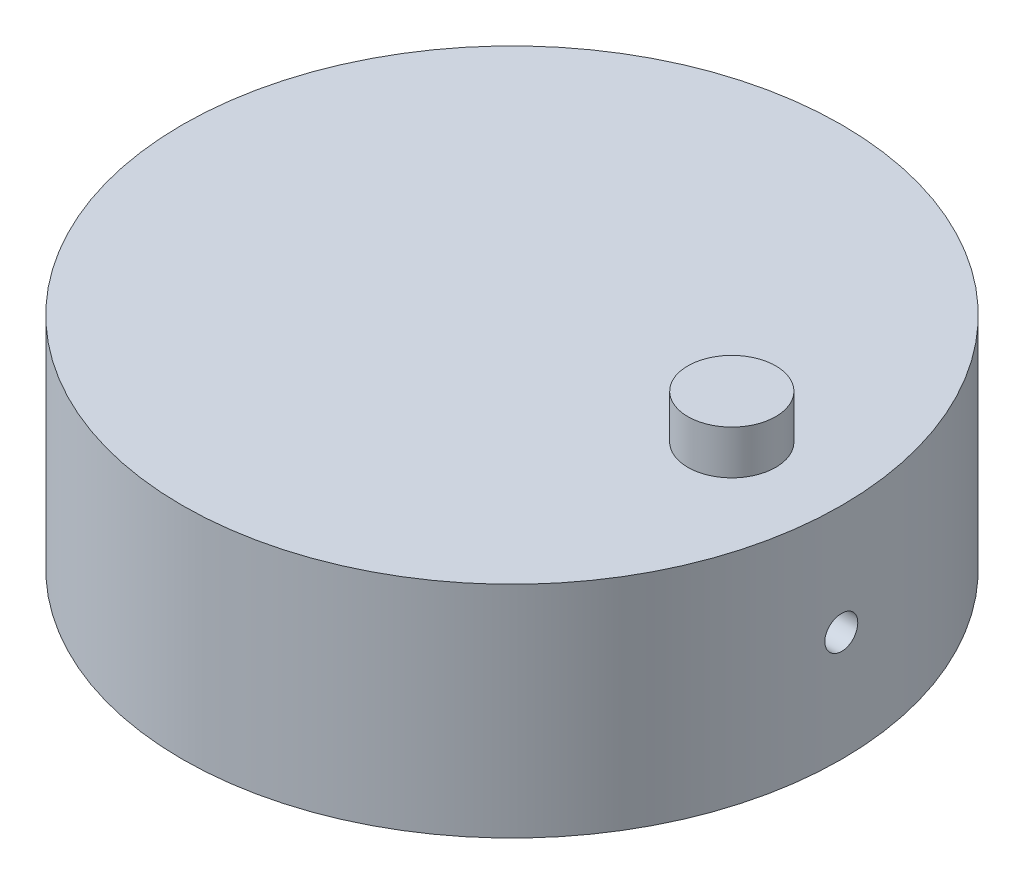
ISO-10303-21;
HEADER;
FILE_DESCRIPTION(('STEP AP214'),'2;1');
FILE_NAME('part.step','',(''),(''),'','','');
FILE_SCHEMA(('AUTOMOTIVE_DESIGN { 1 0 10303 214 1 1 1 1 }'));
ENDSEC;
DATA;
#1=APPLICATION_CONTEXT('core data for automotive mechanical design processes');
#2=APPLICATION_PROTOCOL_DEFINITION('international standard','automotive_design',2000,#1);
#3=PRODUCT_CONTEXT('',#1,'mechanical');
#4=PRODUCT('Part','Part','',(#3));
#5=PRODUCT_RELATED_PRODUCT_CATEGORY('part','',(#4));
#6=PRODUCT_DEFINITION_FORMATION('','',#4);
#7=PRODUCT_DEFINITION_CONTEXT('part definition',#1,'design');
#8=PRODUCT_DEFINITION('design','',#6,#7);
#9=PRODUCT_DEFINITION_SHAPE('','',#8);
#10=(LENGTH_UNIT() NAMED_UNIT(*) SI_UNIT(.MILLI.,.METRE.));
#11=(NAMED_UNIT(*) PLANE_ANGLE_UNIT() SI_UNIT($,.RADIAN.));
#12=(NAMED_UNIT(*) SI_UNIT($,.STERADIAN.) SOLID_ANGLE_UNIT());
#13=UNCERTAINTY_MEASURE_WITH_UNIT(LENGTH_MEASURE(1.E-05),#10,'distance_accuracy_value','');
#14=(GEOMETRIC_REPRESENTATION_CONTEXT(3) GLOBAL_UNCERTAINTY_ASSIGNED_CONTEXT((#13)) GLOBAL_UNIT_ASSIGNED_CONTEXT((#10,
#11,#12)) REPRESENTATION_CONTEXT('',''));
#15=CARTESIAN_POINT('',(0.,0.,0.));
#16=DIRECTION('',(0.,0.,1.));
#17=DIRECTION('',(1.,0.,0.));
#18=AXIS2_PLACEMENT_3D('',#15,#16,#17);
#19=CARTESIAN_POINT('',(0.,25.4,0.));
#20=DIRECTION('',(0.,-1.,0.));
#21=DIRECTION('',(0.,0.,-1.));
#22=AXIS2_PLACEMENT_3D('',#19,#20,#21);
#23=CYLINDRICAL_SURFACE('',#22,38.1);
#24=CARTESIAN_POINT('',(0.,25.4,0.));
#25=DIRECTION('',(0.,1.,0.));
#26=DIRECTION('',(0.,0.,1.));
#27=AXIS2_PLACEMENT_3D('',#24,#25,#26);
#28=CIRCLE('',#27,38.1);
#29=CARTESIAN_POINT('',(0.,25.4,38.1));
#30=VERTEX_POINT('',#29);
#31=EDGE_CURVE('E10',#30,#30,#28,.T.);
#32=ORIENTED_EDGE('',*,*,#31,.F.);
#33=EDGE_LOOP('',(#32));
#34=FACE_BOUND('',#33,.T.);
#35=CARTESIAN_POINT('',(0.,0.,0.));
#36=DIRECTION('',(0.,1.,0.));
#37=DIRECTION('',(0.,0.,1.));
#38=AXIS2_PLACEMENT_3D('',#35,#36,#37);
#39=CIRCLE('',#38,38.1);
#40=CARTESIAN_POINT('',(0.,0.,38.1));
#41=VERTEX_POINT('',#40);
#42=EDGE_CURVE('E42',#41,#41,#39,.T.);
#43=ORIENTED_EDGE('',*,*,#42,.T.);
#44=EDGE_LOOP('',(#43));
#45=FACE_BOUND('',#44,.T.);
#46=CARTESIAN_POINT('',(-38.0523451971097,12.7,1.905));
#47=CARTESIAN_POINT('',(-38.0523458372646,12.8069329058887,1.90499528064472));
#48=CARTESIAN_POINT('',(-38.0528007885922,12.9139416456824,1.89596610109282));
#49=CARTESIAN_POINT('',(-38.0545717554989,13.1250071236654,1.86007496828753));
#50=CARTESIAN_POINT('',(-38.0558887856008,13.2290602328458,1.83319200356399));
#51=CARTESIAN_POINT('',(-38.0592343528177,13.4311264111117,1.76236492554558));
#52=CARTESIAN_POINT('',(-38.0612625271739,13.529142529787,1.71842950958169));
#53=CARTESIAN_POINT('',(-38.0658013905468,13.7163819823196,1.61475804513455));
#54=CARTESIAN_POINT('',(-38.0683119656292,13.8056073848713,1.55502572634061));
#55=CARTESIAN_POINT('',(-38.0735356425949,13.9728495144636,1.42138869135168));
#56=CARTESIAN_POINT('',(-38.0762489219195,14.0508562421088,1.347471467199));
#57=CARTESIAN_POINT('',(-38.0815705997685,14.1933614514177,1.18758784411256));
#58=CARTESIAN_POINT('',(-38.0841789940082,14.2578593816932,1.10162095358686));
#59=CARTESIAN_POINT('',(-38.0889983266454,14.3715435255154,0.920026113944173));
#60=CARTESIAN_POINT('',(-38.0912090632333,14.4207219736997,0.824393297644877));
#61=CARTESIAN_POINT('',(-38.0949821658515,14.5023213119101,0.626215542712287));
#62=CARTESIAN_POINT('',(-38.0965445367887,14.5347423287551,0.523670656395613));
#63=CARTESIAN_POINT('',(-38.0988436608447,14.5818801404401,0.314671415599912));
#64=CARTESIAN_POINT('',(-38.09958111,14.5966118615819,0.20822043538528));
#65=CARTESIAN_POINT('',(-38.1001496214684,14.6079989658505,-0.00564587679817677));
#66=CARTESIAN_POINT('',(-38.0999806909141,14.6046544912272,-0.113061201171489));
#67=CARTESIAN_POINT('',(-38.0987560659568,14.5799965295344,-0.325706003577341));
#68=CARTESIAN_POINT('',(-38.0977011644333,14.5586991089818,-0.430937349856055));
#69=CARTESIAN_POINT('',(-38.0948243327178,14.4987647162119,-0.636329424385981));
#70=CARTESIAN_POINT('',(-38.0930023993098,14.4601276712967,-0.736490131376143));
#71=CARTESIAN_POINT('',(-38.0887953674449,14.3665924756375,-0.928949461337829));
#72=CARTESIAN_POINT('',(-38.0864100155674,14.311687004667,-1.02124452091718));
#73=CARTESIAN_POINT('',(-38.0813447741745,14.1871788692309,-1.19531368846816));
#74=CARTESIAN_POINT('',(-38.0786648825792,14.1175761009756,-1.27708772213554));
#75=CARTESIAN_POINT('',(-38.0733088954562,13.9655583099484,-1.4278872770822));
#76=CARTESIAN_POINT('',(-38.0706328072934,13.8831293478395,-1.49689874745763));
#77=CARTESIAN_POINT('',(-38.0655890698724,13.7078479951748,-1.62010594974738));
#78=CARTESIAN_POINT('',(-38.063221420696,13.6149956018493,-1.67430167772501));
#79=CARTESIAN_POINT('',(-38.0590617842516,13.4214946466882,-1.76633774924872));
#80=CARTESIAN_POINT('',(-38.0572698155799,13.3208458331319,-1.80417756445682));
#81=CARTESIAN_POINT('',(-38.0544643313005,13.1146129196291,-1.86241829155642));
#82=CARTESIAN_POINT('',(-38.053450809838,13.0090288568073,-1.88281933460647));
#83=CARTESIAN_POINT('',(-38.0523175970383,12.7960449888861,-1.90558602818999));
#84=CARTESIAN_POINT('',(-38.0521969391894,12.6886472733456,-1.90797118071584));
#85=CARTESIAN_POINT('',(-38.0528605368865,12.474977138936,-1.89468928026818));
#86=CARTESIAN_POINT('',(-38.0536447894401,12.3687047163467,-1.87902228699277));
#87=CARTESIAN_POINT('',(-38.0560289329864,12.1603566346034,-1.83009699828165));
#88=CARTESIAN_POINT('',(-38.0576284100868,12.0582788741965,-1.79684762915572));
#89=CARTESIAN_POINT('',(-38.0614623752182,11.861153002791,-1.71371045085395));
#90=CARTESIAN_POINT('',(-38.063696866924,11.7661049324766,-1.66382254539243));
#91=CARTESIAN_POINT('',(-38.0685513659328,11.5856467874114,-1.54877437789071));
#92=CARTESIAN_POINT('',(-38.0711717031923,11.5002450733202,-1.48360101590895));
#93=CARTESIAN_POINT('',(-38.0765013940179,11.3415879832223,-1.33985110683072));
#94=CARTESIAN_POINT('',(-38.0792107481531,11.2683326848762,-1.26127447404409));
#95=CARTESIAN_POINT('',(-38.0844159277627,11.1359823424576,-1.0928647642513));
#96=CARTESIAN_POINT('',(-38.0869115620206,11.0768998955502,-1.00302178063881));
#97=CARTESIAN_POINT('',(-38.0914053077819,10.9746585099091,-0.814679759205169));
#98=CARTESIAN_POINT('',(-38.0934034214507,10.931499501871,-0.716180759060366));
#99=CARTESIAN_POINT('',(-38.096676024278,10.8623521458311,-0.513369591195925));
#100=CARTESIAN_POINT('',(-38.0979508530247,10.8363557389079,-0.409060176818396));
#101=CARTESIAN_POINT('',(-38.0996345639704,10.8022451358003,-0.19755058821645));
#102=CARTESIAN_POINT('',(-38.1000434510553,10.7941308387221,-0.0903504303055591));
#103=CARTESIAN_POINT('',(-38.0999492193628,10.7960157556136,0.123772590073418));
#104=CARTESIAN_POINT('',(-38.0994470954988,10.8059952094257,0.230695627491621));
#105=CARTESIAN_POINT('',(-38.0975893281055,10.8437435010674,0.441346231640864));
#106=CARTESIAN_POINT('',(-38.0962336829685,10.8715123724055,0.545073792352433));
#107=CARTESIAN_POINT('',(-38.0928213916629,10.9440472019371,0.746393139053872));
#108=CARTESIAN_POINT('',(-38.0907647403447,10.9888132849939,0.843984879963162));
#109=CARTESIAN_POINT('',(-38.0861817342955,11.094068357926,1.03026851942983));
#110=CARTESIAN_POINT('',(-38.0836553939837,11.1545568651525,1.11896069107141));
#111=CARTESIAN_POINT('',(-38.0784142133899,11.2896104505262,1.28502623785079));
#112=CARTESIAN_POINT('',(-38.0756991903811,11.3641892977983,1.36238840889245));
#113=CARTESIAN_POINT('',(-38.0703878795251,11.5252975974591,1.50351876872457));
#114=CARTESIAN_POINT('',(-38.0677916210558,11.6118299856467,1.56728360818367));
#115=CARTESIAN_POINT('',(-38.063008920605,11.7944571185154,1.67943918705236));
#116=CARTESIAN_POINT('',(-38.0608228743648,11.8905609616039,1.72781511137468));
#117=CARTESIAN_POINT('',(-38.0571134110098,12.0894656824505,1.80768707555726));
#118=CARTESIAN_POINT('',(-38.0555892116128,12.192258487834,1.83920305362945));
#119=CARTESIAN_POINT('',(-38.053778892819,12.3630749584445,1.87619376168079));
#120=CARTESIAN_POINT('',(-38.0532436280332,12.4299922096741,1.88698230952193));
#121=CARTESIAN_POINT('',(-38.0525265776354,12.5645961705465,1.90138691991544));
#122=CARTESIAN_POINT('',(-38.0523447917205,12.6322828795301,1.90500298861372));
#123=CARTESIAN_POINT('',(-38.0523451971097,12.7,1.905));
#124=B_SPLINE_CURVE_WITH_KNOTS('',3,(#46,#47,#48,#49,#50,#51,#52,#53,#54,#55,#56,#57,#58,#59,
#60,#61,#62,#63,#64,#65,#66,#67,#68,#69,#70,#71,#72,#73,#74,#75,#76,#77,#78,#79,#80,#81,#82,#83,
#84,#85,#86,#87,#88,#89,#90,#91,#92,#93,#94,#95,#96,#97,#98,#99,#100,#101,#102,#103,#104,#105,
#106,#107,#108,#109,#110,#111,#112,#113,#114,#115,#116,#117,#118,#119,#120,#121,#122,#123),
.UNSPECIFIED.,.T.,.F.,(4,2,2,2,2,2,2,2,2,2,2,2,2,2,2,2,2,2,2,2,2,2,2,2,2,2,2,2,2,2,2,2,2,2,2,2,
2,2,4),(0.,0.320551524060625,0.641480963626901,0.962246932890589,1.28293723599337,
1.60391162746204,1.92489911758192,2.24604905074975,2.56719655344554,2.8880728796769,
3.20894668078709,3.52953362880772,3.8501219209292,4.17085468627854,4.49158971666373,
4.81267578403358,5.13376193671906,5.45485846053676,5.77595256933768,6.0966990476117,
6.417444465186,6.73802720121333,7.05861179245548,7.37947214158489,7.70033454212426,
8.02148108472431,8.34262622956469,8.66362046909027,8.98461289750674,9.30525498171338,
9.62589766989188,9.94654271359421,10.2671779152597,10.588128078616,10.9091572081926,
11.2304944674288,11.5514508753209,11.7544458710267,11.9574406927911),.UNSPECIFIED.);
#125=CARTESIAN_POINT('',(-38.0523451971097,12.7,1.905));
#126=VERTEX_POINT('',#125);
#127=EDGE_CURVE('E52',#126,#126,#124,.T.);
#128=ORIENTED_EDGE('',*,*,#127,.F.);
#129=EDGE_LOOP('',(#128));
#130=FACE_BOUND('',#129,.T.);
#131=CARTESIAN_POINT('',(38.0523451971097,12.7,1.905));
#132=CARTESIAN_POINT('',(38.0523458372646,12.5930670941113,1.90499528064472));
#133=CARTESIAN_POINT('',(38.0528007885922,12.4860583543176,1.89596610109282));
#134=CARTESIAN_POINT('',(38.0545717554989,12.2749928763346,1.86007496828753));
#135=CARTESIAN_POINT('',(38.0558887856008,12.1709397671542,1.83319200356399));
#136=CARTESIAN_POINT('',(38.0592343528177,11.9688735888883,1.76236492554558));
#137=CARTESIAN_POINT('',(38.0612625271739,11.870857470213,1.71842950958169));
#138=CARTESIAN_POINT('',(38.0658013905468,11.6836180176804,1.61475804513455));
#139=CARTESIAN_POINT('',(38.0683119656292,11.5943926151287,1.55502572634061));
#140=CARTESIAN_POINT('',(38.0735356425949,11.4271504855364,1.42138869135168));
#141=CARTESIAN_POINT('',(38.0762489219195,11.3491437578912,1.347471467199));
#142=CARTESIAN_POINT('',(38.0815705997685,11.2066385485823,1.18758784411256));
#143=CARTESIAN_POINT('',(38.0841789940082,11.1421406183068,1.10162095358686));
#144=CARTESIAN_POINT('',(38.0889983266454,11.0284564744846,0.920026113944173));
#145=CARTESIAN_POINT('',(38.0912090632333,10.9792780263003,0.824393297644877));
#146=CARTESIAN_POINT('',(38.0949821658515,10.8976786880899,0.626215542712287));
#147=CARTESIAN_POINT('',(38.0965445367887,10.8652576712449,0.523670656395613));
#148=CARTESIAN_POINT('',(38.0988436608447,10.8181198595599,0.314671415599912));
#149=CARTESIAN_POINT('',(38.09958111,10.8033881384181,0.20822043538528));
#150=CARTESIAN_POINT('',(38.1001496214684,10.7920010341495,-0.00564587679817677));
#151=CARTESIAN_POINT('',(38.0999806909141,10.7953455087728,-0.113061201171489));
#152=CARTESIAN_POINT('',(38.0987560659568,10.8200034704656,-0.325706003577341));
#153=CARTESIAN_POINT('',(38.0977011644333,10.8413008910182,-0.430937349856055));
#154=CARTESIAN_POINT('',(38.0948243327178,10.9012352837881,-0.636329424385981));
#155=CARTESIAN_POINT('',(38.0930023993098,10.9398723287033,-0.736490131376143));
#156=CARTESIAN_POINT('',(38.0887953674449,11.0334075243625,-0.928949461337829));
#157=CARTESIAN_POINT('',(38.0864100155674,11.088312995333,-1.02124452091718));
#158=CARTESIAN_POINT('',(38.0813447741745,11.2128211307691,-1.19531368846816));
#159=CARTESIAN_POINT('',(38.0786648825792,11.2824238990244,-1.27708772213554));
#160=CARTESIAN_POINT('',(38.0733088954562,11.4344416900515,-1.4278872770822));
#161=CARTESIAN_POINT('',(38.0706328072934,11.5168706521605,-1.49689874745763));
#162=CARTESIAN_POINT('',(38.0655890698724,11.6921520048252,-1.62010594974738));
#163=CARTESIAN_POINT('',(38.063221420696,11.7850043981507,-1.67430167772501));
#164=CARTESIAN_POINT('',(38.0590617842516,11.9785053533118,-1.76633774924872));
#165=CARTESIAN_POINT('',(38.0572698155799,12.0791541668681,-1.80417756445682));
#166=CARTESIAN_POINT('',(38.0544643313005,12.2853870803709,-1.86241829155642));
#167=CARTESIAN_POINT('',(38.053450809838,12.3909711431927,-1.88281933460647));
#168=CARTESIAN_POINT('',(38.0523175970383,12.6039550111139,-1.90558602818999));
#169=CARTESIAN_POINT('',(38.0521969391894,12.7113527266544,-1.90797118071584));
#170=CARTESIAN_POINT('',(38.0528605368865,12.925022861064,-1.89468928026818));
#171=CARTESIAN_POINT('',(38.0536447894401,13.0312952836533,-1.87902228699277));
#172=CARTESIAN_POINT('',(38.0560289329864,13.2396433653966,-1.83009699828165));
#173=CARTESIAN_POINT('',(38.0576284100868,13.3417211258035,-1.79684762915572));
#174=CARTESIAN_POINT('',(38.0614623752182,13.538846997209,-1.71371045085395));
#175=CARTESIAN_POINT('',(38.063696866924,13.6338950675234,-1.66382254539243));
#176=CARTESIAN_POINT('',(38.0685513659328,13.8143532125886,-1.54877437789071));
#177=CARTESIAN_POINT('',(38.0711717031923,13.8997549266798,-1.48360101590895));
#178=CARTESIAN_POINT('',(38.0765013940179,14.0584120167777,-1.33985110683072));
#179=CARTESIAN_POINT('',(38.0792107481531,14.1316673151238,-1.26127447404409));
#180=CARTESIAN_POINT('',(38.0844159277627,14.2640176575424,-1.0928647642513));
#181=CARTESIAN_POINT('',(38.0869115620206,14.3231001044498,-1.00302178063881));
#182=CARTESIAN_POINT('',(38.0914053077819,14.4253414900909,-0.814679759205169));
#183=CARTESIAN_POINT('',(38.0934034214507,14.468500498129,-0.716180759060366));
#184=CARTESIAN_POINT('',(38.096676024278,14.5376478541689,-0.513369591195925));
#185=CARTESIAN_POINT('',(38.0979508530247,14.5636442610921,-0.409060176818396));
#186=CARTESIAN_POINT('',(38.0996345639704,14.5977548641997,-0.19755058821645));
#187=CARTESIAN_POINT('',(38.1000434510553,14.6058691612779,-0.0903504303055591));
#188=CARTESIAN_POINT('',(38.0999492193628,14.6039842443864,0.123772590073418));
#189=CARTESIAN_POINT('',(38.0994470954988,14.5940047905743,0.230695627491621));
#190=CARTESIAN_POINT('',(38.0975893281055,14.5562564989326,0.441346231640864));
#191=CARTESIAN_POINT('',(38.0962336829685,14.5284876275945,0.545073792352433));
#192=CARTESIAN_POINT('',(38.0928213916629,14.4559527980629,0.746393139053872));
#193=CARTESIAN_POINT('',(38.0907647403447,14.4111867150061,0.843984879963162));
#194=CARTESIAN_POINT('',(38.0861817342955,14.305931642074,1.03026851942983));
#195=CARTESIAN_POINT('',(38.0836553939837,14.2454431348475,1.11896069107141));
#196=CARTESIAN_POINT('',(38.0784142133899,14.1103895494738,1.28502623785079));
#197=CARTESIAN_POINT('',(38.0756991903811,14.0358107022017,1.36238840889245));
#198=CARTESIAN_POINT('',(38.0703878795251,13.8747024025409,1.50351876872457));
#199=CARTESIAN_POINT('',(38.0677916210558,13.7881700143533,1.56728360818367));
#200=CARTESIAN_POINT('',(38.063008920605,13.6055428814846,1.67943918705236));
#201=CARTESIAN_POINT('',(38.0608228743648,13.5094390383961,1.72781511137468));
#202=CARTESIAN_POINT('',(38.0571134110098,13.3105343175495,1.80768707555726));
#203=CARTESIAN_POINT('',(38.0555892116128,13.207741512166,1.83920305362945));
#204=CARTESIAN_POINT('',(38.053778892819,13.0369250415555,1.87619376168079));
#205=CARTESIAN_POINT('',(38.0532436280332,12.9700077903259,1.88698230952193));
#206=CARTESIAN_POINT('',(38.0525265776354,12.8354038294535,1.90138691991544));
#207=CARTESIAN_POINT('',(38.0523447917205,12.7677171204699,1.90500298861372));
#208=CARTESIAN_POINT('',(38.0523451971097,12.7,1.905));
#209=B_SPLINE_CURVE_WITH_KNOTS('',3,(#131,#132,#133,#134,#135,#136,#137,#138,#139,#140,#141,
#142,#143,#144,#145,#146,#147,#148,#149,#150,#151,#152,#153,#154,#155,#156,#157,#158,#159,#160,
#161,#162,#163,#164,#165,#166,#167,#168,#169,#170,#171,#172,#173,#174,#175,#176,#177,#178,#179,
#180,#181,#182,#183,#184,#185,#186,#187,#188,#189,#190,#191,#192,#193,#194,#195,#196,#197,#198,
#199,#200,#201,#202,#203,#204,#205,#206,#207,#208),.UNSPECIFIED.,.T.,.F.,(4,2,2,2,2,2,2,2,2,2,2,
2,2,2,2,2,2,2,2,2,2,2,2,2,2,2,2,2,2,2,2,2,2,2,2,2,2,2,4),(0.,0.320551524060625,
0.641480963626901,0.962246932890589,1.28293723599337,1.60391162746204,1.92489911758192,
2.24604905074975,2.56719655344554,2.8880728796769,3.20894668078709,3.52953362880772,
3.8501219209292,4.17085468627854,4.49158971666373,4.81267578403358,5.13376193671906,
5.45485846053676,5.77595256933768,6.0966990476117,6.417444465186,6.73802720121333,
7.05861179245548,7.37947214158489,7.70033454212426,8.02148108472431,8.34262622956469,
8.66362046909027,8.98461289750674,9.30525498171338,9.62589766989188,9.94654271359421,
10.2671779152597,10.588128078616,10.9091572081926,11.2304944674288,11.5514508753209,
11.7544458710267,11.9574406927911),.UNSPECIFIED.);
#210=CARTESIAN_POINT('',(38.0523451971097,12.7,1.905));
#211=VERTEX_POINT('',#210);
#212=EDGE_CURVE('E34',#211,#211,#209,.T.);
#213=ORIENTED_EDGE('',*,*,#212,.F.);
#214=EDGE_LOOP('',(#213));
#215=FACE_BOUND('',#214,.T.);
#216=ADVANCED_FACE('F30',(#34,#45,#130,#215),#23,.T.);
#217=CARTESIAN_POINT('',(0.,25.4,0.));
#218=DIRECTION('',(0.,1.,0.));
#219=DIRECTION('',(0.,0.,1.));
#220=AXIS2_PLACEMENT_3D('',#217,#218,#219);
#221=PLANE('',#220);
#222=CARTESIAN_POINT('',(25.4,25.4,0.));
#223=DIRECTION('',(0.,1.,0.));
#224=DIRECTION('',(0.,0.,1.));
#225=AXIS2_PLACEMENT_3D('',#222,#223,#224);
#226=CIRCLE('',#225,5.08);
#227=CARTESIAN_POINT('',(25.4,25.4,5.08));
#228=VERTEX_POINT('',#227);
#229=EDGE_CURVE('E50',#228,#228,#226,.T.);
#230=ORIENTED_EDGE('',*,*,#229,.F.);
#231=EDGE_LOOP('',(#230));
#232=FACE_BOUND('',#231,.T.);
#233=ORIENTED_EDGE('',*,*,#31,.T.);
#234=EDGE_LOOP('',(#233));
#235=FACE_BOUND('',#234,.T.);
#236=ADVANCED_FACE('F72',(#232,#235),#221,.T.);
#237=CARTESIAN_POINT('',(0.,0.,0.));
#238=DIRECTION('',(0.,1.,0.));
#239=DIRECTION('',(0.,0.,1.));
#240=AXIS2_PLACEMENT_3D('',#237,#238,#239);
#241=PLANE('',#240);
#242=ORIENTED_EDGE('',*,*,#42,.F.);
#243=EDGE_LOOP('',(#242));
#244=FACE_BOUND('',#243,.T.);
#245=ADVANCED_FACE('F70',(#244),#241,.F.);
#246=CARTESIAN_POINT('',(25.4,30.48,0.));
#247=DIRECTION('',(0.,-1.,0.));
#248=DIRECTION('',(0.,0.,-1.));
#249=AXIS2_PLACEMENT_3D('',#246,#247,#248);
#250=CYLINDRICAL_SURFACE('',#249,5.08);
#251=CARTESIAN_POINT('',(25.4,30.48,0.));
#252=DIRECTION('',(0.,1.,0.));
#253=DIRECTION('',(0.,0.,1.));
#254=AXIS2_PLACEMENT_3D('',#251,#252,#253);
#255=CIRCLE('',#254,5.08);
#256=CARTESIAN_POINT('',(25.4,30.48,5.08));
#257=VERTEX_POINT('',#256);
#258=EDGE_CURVE('E47',#257,#257,#255,.T.);
#259=ORIENTED_EDGE('',*,*,#258,.F.);
#260=EDGE_LOOP('',(#259));
#261=FACE_BOUND('',#260,.T.);
#262=ORIENTED_EDGE('',*,*,#229,.T.);
#263=EDGE_LOOP('',(#262));
#264=FACE_BOUND('',#263,.T.);
#265=ADVANCED_FACE('F66',(#261,#264),#250,.T.);
#266=CARTESIAN_POINT('',(25.4,30.48,0.));
#267=DIRECTION('',(0.,1.,0.));
#268=DIRECTION('',(0.,0.,1.));
#269=AXIS2_PLACEMENT_3D('',#266,#267,#268);
#270=PLANE('',#269);
#271=ORIENTED_EDGE('',*,*,#258,.T.);
#272=EDGE_LOOP('',(#271));
#273=FACE_BOUND('',#272,.T.);
#274=ADVANCED_FACE('F61',(#273),#270,.T.);
#275=CARTESIAN_POINT('',(46.228,12.7,0.));
#276=DIRECTION('',(-1.,0.,0.));
#277=DIRECTION('',(0.,0.,1.));
#278=AXIS2_PLACEMENT_3D('',#275,#276,#277);
#279=CYLINDRICAL_SURFACE('',#278,1.905);
#280=ORIENTED_EDGE('',*,*,#127,.T.);
#281=EDGE_LOOP('',(#280));
#282=FACE_BOUND('',#281,.T.);
#283=ORIENTED_EDGE('',*,*,#212,.T.);
#284=EDGE_LOOP('',(#283));
#285=FACE_BOUND('',#284,.T.);
#286=ADVANCED_FACE('F57',(#282,#285),#279,.F.);
#287=CLOSED_SHELL('',(#216,#236,#245,#265,#274,#286));
#288=MANIFOLD_SOLID_BREP('B2',#287);
#289=ADVANCED_BREP_SHAPE_REPRESENTATION('',(#18,#288),#14);
#290=SHAPE_DEFINITION_REPRESENTATION(#9,#289);
ENDSEC;
END-ISO-10303-21;
